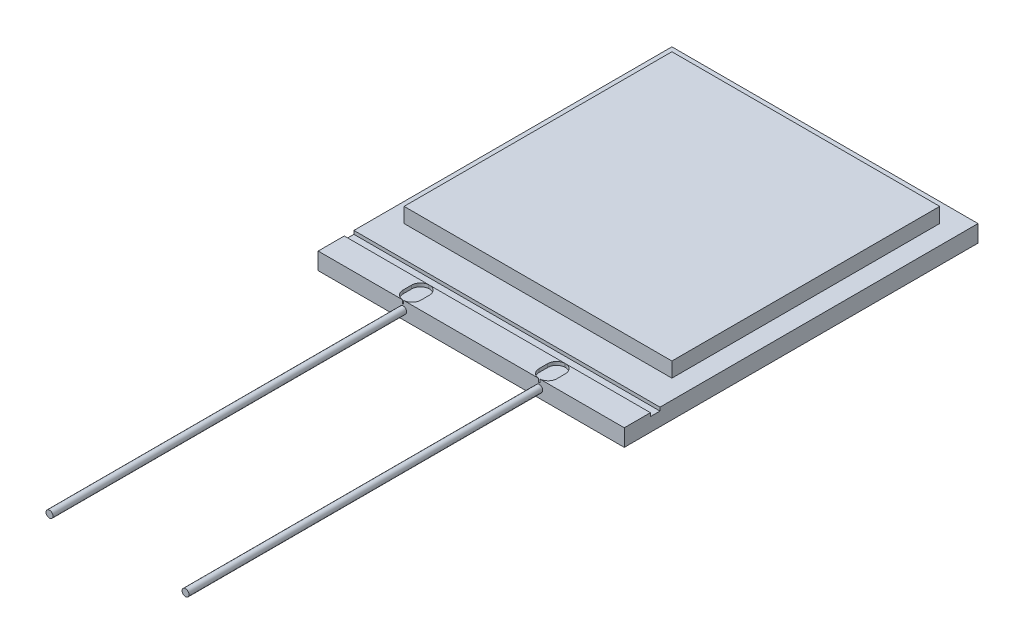
ISO-10303-21;
HEADER;
FILE_DESCRIPTION(('STEP AP214'),'2;1');
FILE_NAME('part.step','',(''),(''),'','','');
FILE_SCHEMA(('AUTOMOTIVE_DESIGN { 1 0 10303 214 1 1 1 1 }'));
ENDSEC;
DATA;
#1=APPLICATION_CONTEXT('core data for automotive mechanical design processes');
#2=APPLICATION_PROTOCOL_DEFINITION('international standard','automotive_design',2000,#1);
#3=PRODUCT_CONTEXT('',#1,'mechanical');
#4=PRODUCT('Part','Part','',(#3));
#5=PRODUCT_RELATED_PRODUCT_CATEGORY('part','',(#4));
#6=PRODUCT_DEFINITION_FORMATION('','',#4);
#7=PRODUCT_DEFINITION_CONTEXT('part definition',#1,'design');
#8=PRODUCT_DEFINITION('design','',#6,#7);
#9=PRODUCT_DEFINITION_SHAPE('','',#8);
#10=(LENGTH_UNIT() NAMED_UNIT(*) SI_UNIT(.MILLI.,.METRE.));
#11=(NAMED_UNIT(*) PLANE_ANGLE_UNIT() SI_UNIT($,.RADIAN.));
#12=(NAMED_UNIT(*) SI_UNIT($,.STERADIAN.) SOLID_ANGLE_UNIT());
#13=UNCERTAINTY_MEASURE_WITH_UNIT(LENGTH_MEASURE(1.E-05),#10,'distance_accuracy_value','');
#14=(GEOMETRIC_REPRESENTATION_CONTEXT(3) GLOBAL_UNCERTAINTY_ASSIGNED_CONTEXT((#13)) GLOBAL_UNIT_ASSIGNED_CONTEXT((#10,
#11,#12)) REPRESENTATION_CONTEXT('',''));
#15=CARTESIAN_POINT('',(0.,0.,0.));
#16=DIRECTION('',(0.,0.,1.));
#17=DIRECTION('',(1.,0.,0.));
#18=AXIS2_PLACEMENT_3D('',#15,#16,#17);
#19=CARTESIAN_POINT('',(5.715,0.635,6.604));
#20=DIRECTION('',(0.,0.,-1.));
#21=DIRECTION('',(-1.,0.,0.));
#22=AXIS2_PLACEMENT_3D('',#19,#20,#21);
#23=PLANE('',#22);
#24=DIRECTION('',(0.,1.,0.));
#25=VECTOR('',#24,1.);
#26=CARTESIAN_POINT('',(2.56024760363874,0.508,6.604));
#27=LINE('',#26,#25);
#28=CARTESIAN_POINT('',(2.56024760363874,0.508,6.604));
#29=VERTEX_POINT('',#28);
#30=CARTESIAN_POINT('',(2.56024760363874,0.635,6.604));
#31=VERTEX_POINT('',#30);
#32=EDGE_CURVE('E343',#29,#31,#27,.T.);
#33=ORIENTED_EDGE('',*,*,#32,.F.);
#34=DIRECTION('',(1.,0.,0.));
#35=VECTOR('',#34,1.);
#36=CARTESIAN_POINT('',(0.,0.508,6.604));
#37=LINE('',#36,#35);
#38=CARTESIAN_POINT('',(2.51975239636126,0.508,6.604));
#39=VERTEX_POINT('',#38);
#40=EDGE_CURVE('E693',#39,#29,#37,.T.);
#41=ORIENTED_EDGE('',*,*,#40,.F.);
#42=DIRECTION('',(0.,1.,0.));
#43=VECTOR('',#42,1.);
#44=CARTESIAN_POINT('',(2.51975239636126,0.508,6.604));
#45=LINE('',#44,#43);
#46=CARTESIAN_POINT('',(2.51975239636126,0.635,6.604));
#47=VERTEX_POINT('',#46);
#48=EDGE_CURVE('E360',#39,#47,#45,.T.);
#49=ORIENTED_EDGE('',*,*,#48,.T.);
#50=DIRECTION('',(1.,0.,0.));
#51=VECTOR('',#50,1.);
#52=CARTESIAN_POINT('',(5.715,0.635,6.604));
#53=LINE('',#52,#51);
#54=CARTESIAN_POINT('',(-2.51975239636126,0.635,6.604));
#55=VERTEX_POINT('',#54);
#56=EDGE_CURVE('E490',#55,#47,#53,.T.);
#57=ORIENTED_EDGE('',*,*,#56,.F.);
#58=DIRECTION('',(0.,1.,0.));
#59=VECTOR('',#58,1.);
#60=CARTESIAN_POINT('',(-2.51975239636126,0.508,6.604));
#61=LINE('',#60,#59);
#62=CARTESIAN_POINT('',(-2.51975239636126,0.508,6.604));
#63=VERTEX_POINT('',#62);
#64=EDGE_CURVE('E674',#63,#55,#61,.T.);
#65=ORIENTED_EDGE('',*,*,#64,.F.);
#66=DIRECTION('',(1.,0.,0.));
#67=VECTOR('',#66,1.);
#68=CARTESIAN_POINT('',(0.,0.508,6.604));
#69=LINE('',#68,#67);
#70=CARTESIAN_POINT('',(-2.56024760363874,0.508,6.604));
#71=VERTEX_POINT('',#70);
#72=EDGE_CURVE('E530',#71,#63,#69,.T.);
#73=ORIENTED_EDGE('',*,*,#72,.F.);
#74=DIRECTION('',(0.,1.,0.));
#75=VECTOR('',#74,1.);
#76=CARTESIAN_POINT('',(-2.56024760363874,0.508,6.604));
#77=LINE('',#76,#75);
#78=CARTESIAN_POINT('',(-2.56024760363874,0.635,6.604));
#79=VERTEX_POINT('',#78);
#80=EDGE_CURVE('E363',#71,#79,#77,.T.);
#81=ORIENTED_EDGE('',*,*,#80,.T.);
#82=CARTESIAN_POINT('',(-5.715,0.635,6.604));
#83=VERTEX_POINT('',#82);
#84=EDGE_CURVE('E486',#83,#79,#53,.T.);
#85=ORIENTED_EDGE('',*,*,#84,.F.);
#86=DIRECTION('',(0.,-1.,0.));
#87=VECTOR('',#86,1.);
#88=CARTESIAN_POINT('',(-5.715,0.635,6.604));
#89=LINE('',#88,#87);
#90=CARTESIAN_POINT('',(-5.715,0.,6.604));
#91=VERTEX_POINT('',#90);
#92=EDGE_CURVE('E504',#83,#91,#89,.T.);
#93=ORIENTED_EDGE('',*,*,#92,.T.);
#94=DIRECTION('',(1.,0.,0.));
#95=VECTOR('',#94,1.);
#96=CARTESIAN_POINT('',(5.715,0.,6.604));
#97=LINE('',#96,#95);
#98=CARTESIAN_POINT('',(5.715,0.,6.604));
#99=VERTEX_POINT('',#98);
#100=EDGE_CURVE('E501',#91,#99,#97,.T.);
#101=ORIENTED_EDGE('',*,*,#100,.T.);
#102=DIRECTION('',(0.,-1.,0.));
#103=VECTOR('',#102,1.);
#104=CARTESIAN_POINT('',(5.715,0.635,6.604));
#105=LINE('',#104,#103);
#106=CARTESIAN_POINT('',(5.715,0.635,6.604));
#107=VERTEX_POINT('',#106);
#108=EDGE_CURVE('E444',#107,#99,#105,.T.);
#109=ORIENTED_EDGE('',*,*,#108,.F.);
#110=EDGE_CURVE('E346',#31,#107,#53,.T.);
#111=ORIENTED_EDGE('',*,*,#110,.F.);
#112=EDGE_LOOP('',(#33,#41,#49,#57,#65,#73,#81,#85,#93,#101,#109,#111));
#113=FACE_BOUND('',#112,.T.);
#114=CARTESIAN_POINT('',(-2.54,0.3175,6.604));
#115=DIRECTION('',(0.,0.,-1.));
#116=DIRECTION('',(-1.,0.,0.));
#117=AXIS2_PLACEMENT_3D('',#114,#115,#116);
#118=CIRCLE('',#117,0.129854710524441);
#119=CARTESIAN_POINT('',(-2.66985471052444,0.3175,6.604));
#120=VERTEX_POINT('',#119);
#121=EDGE_CURVE('E153',#120,#120,#118,.F.);
#122=ORIENTED_EDGE('',*,*,#121,.F.);
#123=EDGE_LOOP('',(#122));
#124=FACE_BOUND('',#123,.T.);
#125=CARTESIAN_POINT('',(2.54,0.3175,6.604));
#126=DIRECTION('',(0.,0.,-1.));
#127=DIRECTION('',(-1.,0.,0.));
#128=AXIS2_PLACEMENT_3D('',#125,#126,#127);
#129=CIRCLE('',#128,0.129854710524441);
#130=CARTESIAN_POINT('',(2.41014528947556,0.3175,6.604));
#131=VERTEX_POINT('',#130);
#132=EDGE_CURVE('E13',#131,#131,#129,.F.);
#133=ORIENTED_EDGE('',*,*,#132,.F.);
#134=EDGE_LOOP('',(#133));
#135=FACE_BOUND('',#134,.T.);
#136=ADVANCED_FACE('F144',(#113,#124,#135),#23,.F.);
#137=CARTESIAN_POINT('',(-5.715,0.635,-6.604));
#138=DIRECTION('',(0.,1.,0.));
#139=DIRECTION('',(0.,0.,1.));
#140=AXIS2_PLACEMENT_3D('',#137,#138,#139);
#141=PLANE('',#140);
#142=DIRECTION('',(1.,0.,0.));
#143=VECTOR('',#142,1.);
#144=CARTESIAN_POINT('',(0.,0.635,5.62864));
#145=LINE('',#144,#143);
#146=CARTESIAN_POINT('',(2.56511819770642,0.635,5.62864));
#147=VERTEX_POINT('',#146);
#148=CARTESIAN_POINT('',(5.715,0.635,5.62864));
#149=VERTEX_POINT('',#148);
#150=EDGE_CURVE('E382',#147,#149,#145,.T.);
#151=ORIENTED_EDGE('',*,*,#150,.F.);
#152=CARTESIAN_POINT('',(2.54,0.635,5.95788324768168));
#153=DIRECTION('',(0.,1.,0.));
#154=DIRECTION('',(0.,0.,1.));
#155=AXIS2_PLACEMENT_3D('',#152,#153,#154);
#156=CIRCLE('',#155,0.3302);
#157=CARTESIAN_POINT('',(2.8702,0.635,5.95788324768168));
#158=VERTEX_POINT('',#157);
#159=EDGE_CURVE('E347',#147,#158,#156,.F.);
#160=ORIENTED_EDGE('',*,*,#159,.T.);
#161=DIRECTION('',(0.,0.,-1.));
#162=VECTOR('',#161,1.);
#163=CARTESIAN_POINT('',(2.8702,0.635,0.));
#164=LINE('',#163,#162);
#165=CARTESIAN_POINT('',(2.8702,0.635,6.27442136818827));
#166=VERTEX_POINT('',#165);
#167=EDGE_CURVE('E331',#166,#158,#164,.T.);
#168=ORIENTED_EDGE('',*,*,#167,.F.);
#169=CARTESIAN_POINT('',(2.54,0.635,6.27442136818827));
#170=DIRECTION('',(0.,1.,0.));
#171=DIRECTION('',(0.,0.,1.));
#172=AXIS2_PLACEMENT_3D('',#169,#170,#171);
#173=CIRCLE('',#172,0.3302);
#174=EDGE_CURVE('E340',#166,#31,#173,.F.);
#175=ORIENTED_EDGE('',*,*,#174,.T.);
#176=ORIENTED_EDGE('',*,*,#110,.T.);
#177=DIRECTION('',(0.,0.,-1.));
#178=VECTOR('',#177,1.);
#179=CARTESIAN_POINT('',(5.715,0.635,6.604));
#180=LINE('',#179,#178);
#181=EDGE_CURVE('E491',#107,#149,#180,.T.);
#182=ORIENTED_EDGE('',*,*,#181,.T.);
#183=EDGE_LOOP('',(#151,#160,#168,#175,#176,#182));
#184=FACE_BOUND('',#183,.T.);
#185=ADVANCED_FACE('F351',(#184),#141,.T.);
#186=DIRECTION('',(0.,0.,-1.));
#187=VECTOR('',#186,1.);
#188=CARTESIAN_POINT('',(2.2098,0.635,0.));
#189=LINE('',#188,#187);
#190=CARTESIAN_POINT('',(2.2098,0.635,6.27442136818827));
#191=VERTEX_POINT('',#190);
#192=CARTESIAN_POINT('',(2.2098,0.635,5.95788324768168));
#193=VERTEX_POINT('',#192);
#194=EDGE_CURVE('E494',#191,#193,#189,.T.);
#195=ORIENTED_EDGE('',*,*,#194,.T.);
#196=CARTESIAN_POINT('',(2.51488180229358,0.635,5.62864));
#197=VERTEX_POINT('',#196);
#198=EDGE_CURVE('E547',#193,#197,#156,.F.);
#199=ORIENTED_EDGE('',*,*,#198,.T.);
#200=CARTESIAN_POINT('',(-2.51488180229357,0.635,5.62864));
#201=VERTEX_POINT('',#200);
#202=EDGE_CURVE('E393',#201,#197,#145,.T.);
#203=ORIENTED_EDGE('',*,*,#202,.F.);
#204=CARTESIAN_POINT('',(-2.54,0.635,5.95788324768168));
#205=DIRECTION('',(0.,1.,0.));
#206=DIRECTION('',(0.,0.,1.));
#207=AXIS2_PLACEMENT_3D('',#204,#205,#206);
#208=CIRCLE('',#207,0.3302);
#209=CARTESIAN_POINT('',(-2.2098,0.635,5.95788324768168));
#210=VERTEX_POINT('',#209);
#211=EDGE_CURVE('E391',#210,#201,#208,.T.);
#212=ORIENTED_EDGE('',*,*,#211,.F.);
#213=DIRECTION('',(0.,0.,-1.));
#214=VECTOR('',#213,1.);
#215=CARTESIAN_POINT('',(-2.2098,0.635,0.));
#216=LINE('',#215,#214);
#217=CARTESIAN_POINT('',(-2.2098,0.635,6.27442136818827));
#218=VERTEX_POINT('',#217);
#219=EDGE_CURVE('E517',#218,#210,#216,.T.);
#220=ORIENTED_EDGE('',*,*,#219,.F.);
#221=CARTESIAN_POINT('',(-2.54,0.635,6.27442136818827));
#222=DIRECTION('',(0.,1.,0.));
#223=DIRECTION('',(0.,0.,1.));
#224=AXIS2_PLACEMENT_3D('',#221,#222,#223);
#225=CIRCLE('',#224,0.3302);
#226=EDGE_CURVE('E676',#55,#218,#225,.T.);
#227=ORIENTED_EDGE('',*,*,#226,.F.);
#228=ORIENTED_EDGE('',*,*,#56,.T.);
#229=EDGE_CURVE('E349',#47,#191,#173,.F.);
#230=ORIENTED_EDGE('',*,*,#229,.T.);
#231=EDGE_LOOP('',(#195,#199,#203,#212,#220,#227,#228,#230));
#232=FACE_BOUND('',#231,.T.);
#233=ADVANCED_FACE('F559',(#232),#141,.T.);
#234=CARTESIAN_POINT('',(-2.8702,0.635,6.27442136818827));
#235=VERTEX_POINT('',#234);
#236=EDGE_CURVE('E615',#235,#79,#225,.T.);
#237=ORIENTED_EDGE('',*,*,#236,.F.);
#238=DIRECTION('',(0.,0.,-1.));
#239=VECTOR('',#238,1.);
#240=CARTESIAN_POINT('',(-2.8702,0.635,0.));
#241=LINE('',#240,#239);
#242=CARTESIAN_POINT('',(-2.8702,0.635,5.95788324768168));
#243=VERTEX_POINT('',#242);
#244=EDGE_CURVE('E503',#235,#243,#241,.T.);
#245=ORIENTED_EDGE('',*,*,#244,.T.);
#246=CARTESIAN_POINT('',(-2.56511819770643,0.635,5.62864));
#247=VERTEX_POINT('',#246);
#248=EDGE_CURVE('E392',#247,#243,#208,.T.);
#249=ORIENTED_EDGE('',*,*,#248,.F.);
#250=CARTESIAN_POINT('',(-5.715,0.635,5.62864));
#251=VERTEX_POINT('',#250);
#252=EDGE_CURVE('E396',#251,#247,#145,.T.);
#253=ORIENTED_EDGE('',*,*,#252,.F.);
#254=DIRECTION('',(0.,0.,1.));
#255=VECTOR('',#254,1.);
#256=CARTESIAN_POINT('',(-5.715,0.635,6.604));
#257=LINE('',#256,#255);
#258=EDGE_CURVE('E487',#251,#83,#257,.T.);
#259=ORIENTED_EDGE('',*,*,#258,.T.);
#260=ORIENTED_EDGE('',*,*,#84,.T.);
#261=EDGE_LOOP('',(#237,#245,#249,#253,#259,#260));
#262=FACE_BOUND('',#261,.T.);
#263=ADVANCED_FACE('F613',(#262),#141,.T.);
#264=DIRECTION('',(1.,0.,0.));
#265=VECTOR('',#264,1.);
#266=CARTESIAN_POINT('',(5.0000027,0.635,4.1110027));
#267=LINE('',#266,#265);
#268=CARTESIAN_POINT('',(-5.0000027,0.635,4.1110027));
#269=VERTEX_POINT('',#268);
#270=CARTESIAN_POINT('',(5.0000027,0.635,4.1110027));
#271=VERTEX_POINT('',#270);
#272=EDGE_CURVE('E467',#269,#271,#267,.T.);
#273=ORIENTED_EDGE('',*,*,#272,.F.);
#274=DIRECTION('',(0.,0.,1.));
#275=VECTOR('',#274,1.);
#276=CARTESIAN_POINT('',(-5.0000027,0.635,4.1110027));
#277=LINE('',#276,#275);
#278=CARTESIAN_POINT('',(-5.0000027,0.635,-5.8890027));
#279=VERTEX_POINT('',#278);
#280=EDGE_CURVE('E462',#279,#269,#277,.T.);
#281=ORIENTED_EDGE('',*,*,#280,.F.);
#282=DIRECTION('',(-1.,0.,0.));
#283=VECTOR('',#282,1.);
#284=CARTESIAN_POINT('',(5.0000027,0.635,-5.8890027));
#285=LINE('',#284,#283);
#286=CARTESIAN_POINT('',(5.0000027,0.635,-5.8890027));
#287=VERTEX_POINT('',#286);
#288=EDGE_CURVE('E474',#287,#279,#285,.T.);
#289=ORIENTED_EDGE('',*,*,#288,.F.);
#290=DIRECTION('',(0.,0.,-1.));
#291=VECTOR('',#290,1.);
#292=CARTESIAN_POINT('',(5.0000027,0.635,4.1110027));
#293=LINE('',#292,#291);
#294=EDGE_CURVE('E470',#271,#287,#293,.T.);
#295=ORIENTED_EDGE('',*,*,#294,.F.);
#296=EDGE_LOOP('',(#273,#281,#289,#295));
#297=FACE_BOUND('',#296,.T.);
#298=CARTESIAN_POINT('',(-5.715,0.635,-6.604));
#299=VERTEX_POINT('',#298);
#300=CARTESIAN_POINT('',(-5.715,0.635,5.2705));
#301=VERTEX_POINT('',#300);
#302=EDGE_CURVE('E483',#299,#301,#257,.T.);
#303=ORIENTED_EDGE('',*,*,#302,.T.);
#304=DIRECTION('',(1.,0.,0.));
#305=VECTOR('',#304,1.);
#306=CARTESIAN_POINT('',(0.,0.635,5.2705));
#307=LINE('',#306,#305);
#308=CARTESIAN_POINT('',(5.715,0.635,5.2705));
#309=VERTEX_POINT('',#308);
#310=EDGE_CURVE('E408',#301,#309,#307,.T.);
#311=ORIENTED_EDGE('',*,*,#310,.T.);
#312=CARTESIAN_POINT('',(5.715,0.635,-6.604));
#313=VERTEX_POINT('',#312);
#314=EDGE_CURVE('E495',#309,#313,#180,.T.);
#315=ORIENTED_EDGE('',*,*,#314,.T.);
#316=DIRECTION('',(-1.,0.,0.));
#317=VECTOR('',#316,1.);
#318=CARTESIAN_POINT('',(5.715,0.635,-6.604));
#319=LINE('',#318,#317);
#320=EDGE_CURVE('E445',#313,#299,#319,.T.);
#321=ORIENTED_EDGE('',*,*,#320,.T.);
#322=EDGE_LOOP('',(#303,#311,#315,#321));
#323=FACE_BOUND('',#322,.T.);
#324=ADVANCED_FACE('F588',(#297,#323),#141,.T.);
#325=CARTESIAN_POINT('',(5.715,0.635,6.604));
#326=DIRECTION('',(-1.,0.,0.));
#327=DIRECTION('',(0.,0.,1.));
#328=AXIS2_PLACEMENT_3D('',#325,#326,#327);
#329=PLANE('',#328);
#330=DIRECTION('',(0.,1.,0.));
#331=VECTOR('',#330,1.);
#332=CARTESIAN_POINT('',(5.715,0.508,5.2705));
#333=LINE('',#332,#331);
#334=CARTESIAN_POINT('',(5.715,0.508,5.2705));
#335=VERTEX_POINT('',#334);
#336=EDGE_CURVE('E414',#335,#309,#333,.T.);
#337=ORIENTED_EDGE('',*,*,#336,.F.);
#338=DIRECTION('',(0.,0.,-1.));
#339=VECTOR('',#338,1.);
#340=CARTESIAN_POINT('',(5.715,0.508,0.));
#341=LINE('',#340,#339);
#342=CARTESIAN_POINT('',(5.715,0.508,5.62864));
#343=VERTEX_POINT('',#342);
#344=EDGE_CURVE('E418',#343,#335,#341,.T.);
#345=ORIENTED_EDGE('',*,*,#344,.F.);
#346=DIRECTION('',(0.,1.,0.));
#347=VECTOR('',#346,1.);
#348=CARTESIAN_POINT('',(5.715,0.508,5.62864));
#349=LINE('',#348,#347);
#350=EDGE_CURVE('E442',#343,#149,#349,.T.);
#351=ORIENTED_EDGE('',*,*,#350,.T.);
#352=ORIENTED_EDGE('',*,*,#181,.F.);
#353=ORIENTED_EDGE('',*,*,#108,.T.);
#354=DIRECTION('',(0.,0.,-1.));
#355=VECTOR('',#354,1.);
#356=CARTESIAN_POINT('',(5.715,0.,6.604));
#357=LINE('',#356,#355);
#358=CARTESIAN_POINT('',(5.715,0.,-6.604));
#359=VERTEX_POINT('',#358);
#360=EDGE_CURVE('E440',#99,#359,#357,.T.);
#361=ORIENTED_EDGE('',*,*,#360,.T.);
#362=DIRECTION('',(0.,-1.,0.));
#363=VECTOR('',#362,1.);
#364=CARTESIAN_POINT('',(5.715,0.635,-6.604));
#365=LINE('',#364,#363);
#366=EDGE_CURVE('E466',#313,#359,#365,.T.);
#367=ORIENTED_EDGE('',*,*,#366,.F.);
#368=ORIENTED_EDGE('',*,*,#314,.F.);
#369=EDGE_LOOP('',(#337,#345,#351,#352,#353,#361,#367,#368));
#370=FACE_BOUND('',#369,.T.);
#371=ADVANCED_FACE('F591',(#370),#329,.F.);
#372=CARTESIAN_POINT('',(-5.715,0.635,6.604));
#373=DIRECTION('',(1.,0.,0.));
#374=DIRECTION('',(0.,0.,-1.));
#375=AXIS2_PLACEMENT_3D('',#372,#373,#374);
#376=PLANE('',#375);
#377=ORIENTED_EDGE('',*,*,#258,.F.);
#378=DIRECTION('',(0.,1.,0.));
#379=VECTOR('',#378,1.);
#380=CARTESIAN_POINT('',(-5.715,0.508,5.62864));
#381=LINE('',#380,#379);
#382=CARTESIAN_POINT('',(-5.715,0.508,5.62864));
#383=VERTEX_POINT('',#382);
#384=EDGE_CURVE('E399',#383,#251,#381,.T.);
#385=ORIENTED_EDGE('',*,*,#384,.F.);
#386=DIRECTION('',(0.,0.,1.));
#387=VECTOR('',#386,1.);
#388=CARTESIAN_POINT('',(-5.715,0.508,0.));
#389=LINE('',#388,#387);
#390=CARTESIAN_POINT('',(-5.715,0.508,5.2705));
#391=VERTEX_POINT('',#390);
#392=EDGE_CURVE('E406',#391,#383,#389,.T.);
#393=ORIENTED_EDGE('',*,*,#392,.F.);
#394=DIRECTION('',(0.,1.,0.));
#395=VECTOR('',#394,1.);
#396=CARTESIAN_POINT('',(-5.715,0.508,5.2705));
#397=LINE('',#396,#395);
#398=EDGE_CURVE('E437',#391,#301,#397,.T.);
#399=ORIENTED_EDGE('',*,*,#398,.T.);
#400=ORIENTED_EDGE('',*,*,#302,.F.);
#401=DIRECTION('',(0.,-1.,0.));
#402=VECTOR('',#401,1.);
#403=CARTESIAN_POINT('',(-5.715,0.635,-6.604));
#404=LINE('',#403,#402);
#405=CARTESIAN_POINT('',(-5.715,0.,-6.604));
#406=VERTEX_POINT('',#405);
#407=EDGE_CURVE('E439',#299,#406,#404,.T.);
#408=ORIENTED_EDGE('',*,*,#407,.T.);
#409=DIRECTION('',(0.,0.,1.));
#410=VECTOR('',#409,1.);
#411=CARTESIAN_POINT('',(-5.715,0.,6.604));
#412=LINE('',#411,#410);
#413=EDGE_CURVE('E497',#406,#91,#412,.T.);
#414=ORIENTED_EDGE('',*,*,#413,.T.);
#415=ORIENTED_EDGE('',*,*,#92,.F.);
#416=EDGE_LOOP('',(#377,#385,#393,#399,#400,#408,#414,#415));
#417=FACE_BOUND('',#416,.T.);
#418=ADVANCED_FACE('F593',(#417),#376,.F.);
#419=CARTESIAN_POINT('',(5.715,0.635,-6.604));
#420=DIRECTION('',(0.,0.,1.));
#421=DIRECTION('',(1.,0.,0.));
#422=AXIS2_PLACEMENT_3D('',#419,#420,#421);
#423=PLANE('',#422);
#424=DIRECTION('',(-1.,0.,0.));
#425=VECTOR('',#424,1.);
#426=CARTESIAN_POINT('',(5.715,0.,-6.604));
#427=LINE('',#426,#425);
#428=EDGE_CURVE('E500',#359,#406,#427,.T.);
#429=ORIENTED_EDGE('',*,*,#428,.T.);
#430=ORIENTED_EDGE('',*,*,#407,.F.);
#431=ORIENTED_EDGE('',*,*,#320,.F.);
#432=ORIENTED_EDGE('',*,*,#366,.T.);
#433=EDGE_LOOP('',(#429,#430,#431,#432));
#434=FACE_BOUND('',#433,.T.);
#435=ADVANCED_FACE('F595',(#434),#423,.F.);
#436=CARTESIAN_POINT('',(-5.715,0.,-6.604));
#437=DIRECTION('',(0.,1.,0.));
#438=DIRECTION('',(0.,0.,1.));
#439=AXIS2_PLACEMENT_3D('',#436,#437,#438);
#440=PLANE('',#439);
#441=ORIENTED_EDGE('',*,*,#413,.F.);
#442=ORIENTED_EDGE('',*,*,#428,.F.);
#443=ORIENTED_EDGE('',*,*,#360,.F.);
#444=ORIENTED_EDGE('',*,*,#100,.F.);
#445=EDGE_LOOP('',(#441,#442,#443,#444));
#446=FACE_BOUND('',#445,.T.);
#447=ADVANCED_FACE('F601',(#446),#440,.F.);
#448=CARTESIAN_POINT('',(-5.0000027,1.190625,4.1110027));
#449=DIRECTION('',(1.,0.,0.));
#450=DIRECTION('',(0.,0.,-1.));
#451=AXIS2_PLACEMENT_3D('',#448,#449,#450);
#452=PLANE('',#451);
#453=ORIENTED_EDGE('',*,*,#280,.T.);
#454=DIRECTION('',(0.,-1.,0.));
#455=VECTOR('',#454,1.);
#456=CARTESIAN_POINT('',(-5.0000027,1.190625,4.1110027));
#457=LINE('',#456,#455);
#458=CARTESIAN_POINT('',(-5.0000027,1.190625,4.1110027));
#459=VERTEX_POINT('',#458);
#460=EDGE_CURVE('E469',#459,#269,#457,.T.);
#461=ORIENTED_EDGE('',*,*,#460,.F.);
#462=DIRECTION('',(0.,0.,1.));
#463=VECTOR('',#462,1.);
#464=CARTESIAN_POINT('',(-5.0000027,1.190625,4.1110027));
#465=LINE('',#464,#463);
#466=CARTESIAN_POINT('',(-5.0000027,1.190625,-5.8890027));
#467=VERTEX_POINT('',#466);
#468=EDGE_CURVE('E419',#467,#459,#465,.T.);
#469=ORIENTED_EDGE('',*,*,#468,.F.);
#470=DIRECTION('',(0.,-1.,0.));
#471=VECTOR('',#470,1.);
#472=CARTESIAN_POINT('',(-5.0000027,1.190625,-5.8890027));
#473=LINE('',#472,#471);
#474=EDGE_CURVE('E465',#467,#279,#473,.T.);
#475=ORIENTED_EDGE('',*,*,#474,.T.);
#476=EDGE_LOOP('',(#453,#461,#469,#475));
#477=FACE_BOUND('',#476,.T.);
#478=ADVANCED_FACE('F779',(#477),#452,.F.);
#479=CARTESIAN_POINT('',(5.0000027,1.190625,4.1110027));
#480=DIRECTION('',(0.,0.,-1.));
#481=DIRECTION('',(-1.,0.,0.));
#482=AXIS2_PLACEMENT_3D('',#479,#480,#481);
#483=PLANE('',#482);
#484=ORIENTED_EDGE('',*,*,#272,.T.);
#485=DIRECTION('',(0.,-1.,0.));
#486=VECTOR('',#485,1.);
#487=CARTESIAN_POINT('',(5.0000027,1.190625,4.1110027));
#488=LINE('',#487,#486);
#489=CARTESIAN_POINT('',(5.0000027,1.190625,4.1110027));
#490=VERTEX_POINT('',#489);
#491=EDGE_CURVE('E473',#490,#271,#488,.T.);
#492=ORIENTED_EDGE('',*,*,#491,.F.);
#493=DIRECTION('',(1.,0.,0.));
#494=VECTOR('',#493,1.);
#495=CARTESIAN_POINT('',(5.0000027,1.190625,4.1110027));
#496=LINE('',#495,#494);
#497=EDGE_CURVE('E459',#459,#490,#496,.T.);
#498=ORIENTED_EDGE('',*,*,#497,.F.);
#499=ORIENTED_EDGE('',*,*,#460,.T.);
#500=EDGE_LOOP('',(#484,#492,#498,#499));
#501=FACE_BOUND('',#500,.T.);
#502=ADVANCED_FACE('F769',(#501),#483,.F.);
#503=CARTESIAN_POINT('',(5.0000027,1.190625,4.1110027));
#504=DIRECTION('',(-1.,0.,0.));
#505=DIRECTION('',(0.,0.,1.));
#506=AXIS2_PLACEMENT_3D('',#503,#504,#505);
#507=PLANE('',#506);
#508=ORIENTED_EDGE('',*,*,#294,.T.);
#509=DIRECTION('',(0.,-1.,0.));
#510=VECTOR('',#509,1.);
#511=CARTESIAN_POINT('',(5.0000027,1.190625,-5.8890027));
#512=LINE('',#511,#510);
#513=CARTESIAN_POINT('',(5.0000027,1.190625,-5.8890027));
#514=VERTEX_POINT('',#513);
#515=EDGE_CURVE('E476',#514,#287,#512,.T.);
#516=ORIENTED_EDGE('',*,*,#515,.F.);
#517=DIRECTION('',(0.,0.,-1.));
#518=VECTOR('',#517,1.);
#519=CARTESIAN_POINT('',(5.0000027,1.190625,4.1110027));
#520=LINE('',#519,#518);
#521=EDGE_CURVE('E453',#490,#514,#520,.T.);
#522=ORIENTED_EDGE('',*,*,#521,.F.);
#523=ORIENTED_EDGE('',*,*,#491,.T.);
#524=EDGE_LOOP('',(#508,#516,#522,#523));
#525=FACE_BOUND('',#524,.T.);
#526=ADVANCED_FACE('F759',(#525),#507,.F.);
#527=CARTESIAN_POINT('',(5.0000027,1.190625,-5.8890027));
#528=DIRECTION('',(0.,0.,1.));
#529=DIRECTION('',(1.,0.,0.));
#530=AXIS2_PLACEMENT_3D('',#527,#528,#529);
#531=PLANE('',#530);
#532=ORIENTED_EDGE('',*,*,#288,.T.);
#533=ORIENTED_EDGE('',*,*,#474,.F.);
#534=DIRECTION('',(-1.,0.,0.));
#535=VECTOR('',#534,1.);
#536=CARTESIAN_POINT('',(5.0000027,1.190625,-5.8890027));
#537=LINE('',#536,#535);
#538=EDGE_CURVE('E451',#514,#467,#537,.T.);
#539=ORIENTED_EDGE('',*,*,#538,.F.);
#540=ORIENTED_EDGE('',*,*,#515,.T.);
#541=EDGE_LOOP('',(#532,#533,#539,#540));
#542=FACE_BOUND('',#541,.T.);
#543=ADVANCED_FACE('F750',(#542),#531,.F.);
#544=CARTESIAN_POINT('',(-5.0000027,1.190625,-5.8890027));
#545=DIRECTION('',(0.,1.,0.));
#546=DIRECTION('',(0.,0.,1.));
#547=AXIS2_PLACEMENT_3D('',#544,#545,#546);
#548=PLANE('',#547);
#549=ORIENTED_EDGE('',*,*,#468,.T.);
#550=ORIENTED_EDGE('',*,*,#497,.T.);
#551=ORIENTED_EDGE('',*,*,#521,.T.);
#552=ORIENTED_EDGE('',*,*,#538,.T.);
#553=EDGE_LOOP('',(#549,#550,#551,#552));
#554=FACE_BOUND('',#553,.T.);
#555=ADVANCED_FACE('F637',(#554),#548,.T.);
#556=CARTESIAN_POINT('',(0.,0.508,5.62864));
#557=DIRECTION('',(0.,0.,1.));
#558=DIRECTION('',(1.,0.,0.));
#559=AXIS2_PLACEMENT_3D('',#556,#557,#558);
#560=PLANE('',#559);
#561=ORIENTED_EDGE('',*,*,#202,.T.);
#562=DIRECTION('',(0.,1.,0.));
#563=VECTOR('',#562,1.);
#564=CARTESIAN_POINT('',(2.51488180229358,0.508,5.62864));
#565=LINE('',#564,#563);
#566=CARTESIAN_POINT('',(2.51488180229358,0.508,5.62864));
#567=VERTEX_POINT('',#566);
#568=EDGE_CURVE('E160',#567,#197,#565,.T.);
#569=ORIENTED_EDGE('',*,*,#568,.F.);
#570=DIRECTION('',(1.,0.,0.));
#571=VECTOR('',#570,1.);
#572=CARTESIAN_POINT('',(0.,0.508,5.62864));
#573=LINE('',#572,#571);
#574=CARTESIAN_POINT('',(-2.51488180229357,0.508,5.62864));
#575=VERTEX_POINT('',#574);
#576=EDGE_CURVE('E381',#575,#567,#573,.T.);
#577=ORIENTED_EDGE('',*,*,#576,.F.);
#578=DIRECTION('',(0.,1.,0.));
#579=VECTOR('',#578,1.);
#580=CARTESIAN_POINT('',(-2.51488180229357,0.508,5.62864));
#581=LINE('',#580,#579);
#582=EDGE_CURVE('E400',#575,#201,#581,.T.);
#583=ORIENTED_EDGE('',*,*,#582,.T.);
#584=EDGE_LOOP('',(#561,#569,#577,#583));
#585=FACE_BOUND('',#584,.T.);
#586=ADVANCED_FACE('F629',(#585),#560,.F.);
#587=ORIENTED_EDGE('',*,*,#252,.T.);
#588=DIRECTION('',(0.,1.,0.));
#589=VECTOR('',#588,1.);
#590=CARTESIAN_POINT('',(-2.56511819770643,0.508,5.62864));
#591=LINE('',#590,#589);
#592=CARTESIAN_POINT('',(-2.56511819770643,0.508,5.62864));
#593=VERTEX_POINT('',#592);
#594=EDGE_CURVE('E388',#593,#247,#591,.T.);
#595=ORIENTED_EDGE('',*,*,#594,.F.);
#596=EDGE_CURVE('E415',#383,#593,#573,.T.);
#597=ORIENTED_EDGE('',*,*,#596,.F.);
#598=ORIENTED_EDGE('',*,*,#384,.T.);
#599=EDGE_LOOP('',(#587,#595,#597,#598));
#600=FACE_BOUND('',#599,.T.);
#601=ADVANCED_FACE('F626',(#600),#560,.F.);
#602=CARTESIAN_POINT('',(0.,0.508,5.2705));
#603=DIRECTION('',(0.,0.,1.));
#604=DIRECTION('',(1.,0.,0.));
#605=AXIS2_PLACEMENT_3D('',#602,#603,#604);
#606=PLANE('',#605);
#607=ORIENTED_EDGE('',*,*,#310,.F.);
#608=ORIENTED_EDGE('',*,*,#398,.F.);
#609=DIRECTION('',(1.,0.,0.));
#610=VECTOR('',#609,1.);
#611=CARTESIAN_POINT('',(0.,0.508,5.2705));
#612=LINE('',#611,#610);
#613=EDGE_CURVE('E429',#391,#335,#612,.T.);
#614=ORIENTED_EDGE('',*,*,#613,.T.);
#615=ORIENTED_EDGE('',*,*,#336,.T.);
#616=EDGE_LOOP('',(#607,#608,#614,#615));
#617=FACE_BOUND('',#616,.T.);
#618=ADVANCED_FACE('F628',(#617),#606,.T.);
#619=ORIENTED_EDGE('',*,*,#150,.T.);
#620=ORIENTED_EDGE('',*,*,#350,.F.);
#621=CARTESIAN_POINT('',(2.56511819770642,0.508,5.62864));
#622=VERTEX_POINT('',#621);
#623=EDGE_CURVE('E416',#622,#343,#573,.T.);
#624=ORIENTED_EDGE('',*,*,#623,.F.);
#625=DIRECTION('',(0.,1.,0.));
#626=VECTOR('',#625,1.);
#627=CARTESIAN_POINT('',(2.56511819770642,0.508,5.62864));
#628=LINE('',#627,#626);
#629=EDGE_CURVE('E378',#622,#147,#628,.T.);
#630=ORIENTED_EDGE('',*,*,#629,.T.);
#631=EDGE_LOOP('',(#619,#620,#624,#630));
#632=FACE_BOUND('',#631,.T.);
#633=ADVANCED_FACE('F631',(#632),#560,.F.);
#634=CARTESIAN_POINT('',(0.,0.508,0.));
#635=DIRECTION('',(0.,1.,0.));
#636=DIRECTION('',(0.,0.,1.));
#637=AXIS2_PLACEMENT_3D('',#634,#635,#636);
#638=PLANE('',#637);
#639=ORIENTED_EDGE('',*,*,#576,.T.);
#640=CARTESIAN_POINT('',(2.54,0.508,5.95788324768168));
#641=DIRECTION('',(0.,1.,0.));
#642=DIRECTION('',(0.,0.,1.));
#643=AXIS2_PLACEMENT_3D('',#640,#641,#642);
#644=CIRCLE('',#643,0.3302);
#645=CARTESIAN_POINT('',(2.2098,0.508,5.95788324768168));
#646=VERTEX_POINT('',#645);
#647=EDGE_CURVE('E358',#646,#567,#644,.F.);
#648=ORIENTED_EDGE('',*,*,#647,.F.);
#649=DIRECTION('',(0.,0.,-1.));
#650=VECTOR('',#649,1.);
#651=CARTESIAN_POINT('',(2.2098,0.508,0.));
#652=LINE('',#651,#650);
#653=CARTESIAN_POINT('',(2.2098,0.508,6.27442136818827));
#654=VERTEX_POINT('',#653);
#655=EDGE_CURVE('E369',#654,#646,#652,.T.);
#656=ORIENTED_EDGE('',*,*,#655,.F.);
#657=CARTESIAN_POINT('',(2.54,0.508,6.27442136818827));
#658=DIRECTION('',(0.,1.,0.));
#659=DIRECTION('',(0.,0.,1.));
#660=AXIS2_PLACEMENT_3D('',#657,#658,#659);
#661=CIRCLE('',#660,0.3302);
#662=EDGE_CURVE('E366',#39,#654,#661,.F.);
#663=ORIENTED_EDGE('',*,*,#662,.F.);
#664=ORIENTED_EDGE('',*,*,#40,.T.);
#665=CARTESIAN_POINT('',(2.8702,0.508,6.27442136818827));
#666=VERTEX_POINT('',#665);
#667=EDGE_CURVE('E353',#666,#29,#661,.F.);
#668=ORIENTED_EDGE('',*,*,#667,.F.);
#669=DIRECTION('',(0.,0.,-1.));
#670=VECTOR('',#669,1.);
#671=CARTESIAN_POINT('',(2.8702,0.508,0.));
#672=LINE('',#671,#670);
#673=CARTESIAN_POINT('',(2.8702,0.508,5.95788324768168));
#674=VERTEX_POINT('',#673);
#675=EDGE_CURVE('E334',#666,#674,#672,.T.);
#676=ORIENTED_EDGE('',*,*,#675,.T.);
#677=EDGE_CURVE('E337',#622,#674,#644,.F.);
#678=ORIENTED_EDGE('',*,*,#677,.F.);
#679=ORIENTED_EDGE('',*,*,#623,.T.);
#680=ORIENTED_EDGE('',*,*,#344,.T.);
#681=ORIENTED_EDGE('',*,*,#613,.F.);
#682=ORIENTED_EDGE('',*,*,#392,.T.);
#683=ORIENTED_EDGE('',*,*,#596,.T.);
#684=CARTESIAN_POINT('',(-2.54,0.508,5.95788324768168));
#685=DIRECTION('',(0.,1.,0.));
#686=DIRECTION('',(0.,0.,1.));
#687=AXIS2_PLACEMENT_3D('',#684,#685,#686);
#688=CIRCLE('',#687,0.3302);
#689=CARTESIAN_POINT('',(-2.8702,0.508,5.95788324768168));
#690=VERTEX_POINT('',#689);
#691=EDGE_CURVE('E518',#593,#690,#688,.T.);
#692=ORIENTED_EDGE('',*,*,#691,.T.);
#693=DIRECTION('',(0.,0.,-1.));
#694=VECTOR('',#693,1.);
#695=CARTESIAN_POINT('',(-2.8702,0.508,0.));
#696=LINE('',#695,#694);
#697=CARTESIAN_POINT('',(-2.8702,0.508,6.27442136818827));
#698=VERTEX_POINT('',#697);
#699=EDGE_CURVE('E522',#698,#690,#696,.T.);
#700=ORIENTED_EDGE('',*,*,#699,.F.);
#701=CARTESIAN_POINT('',(-2.54,0.508,6.27442136818827));
#702=DIRECTION('',(0.,1.,0.));
#703=DIRECTION('',(0.,0.,1.));
#704=AXIS2_PLACEMENT_3D('',#701,#702,#703);
#705=CIRCLE('',#704,0.3302);
#706=EDGE_CURVE('E527',#698,#71,#705,.T.);
#707=ORIENTED_EDGE('',*,*,#706,.T.);
#708=ORIENTED_EDGE('',*,*,#72,.T.);
#709=CARTESIAN_POINT('',(-2.2098,0.508,6.27442136818827));
#710=VERTEX_POINT('',#709);
#711=EDGE_CURVE('E531',#63,#710,#705,.T.);
#712=ORIENTED_EDGE('',*,*,#711,.T.);
#713=DIRECTION('',(0.,0.,-1.));
#714=VECTOR('',#713,1.);
#715=CARTESIAN_POINT('',(-2.2098,0.508,0.));
#716=LINE('',#715,#714);
#717=CARTESIAN_POINT('',(-2.2098,0.508,5.95788324768168));
#718=VERTEX_POINT('',#717);
#719=EDGE_CURVE('E424',#710,#718,#716,.T.);
#720=ORIENTED_EDGE('',*,*,#719,.T.);
#721=EDGE_CURVE('E515',#718,#575,#688,.T.);
#722=ORIENTED_EDGE('',*,*,#721,.T.);
#723=EDGE_LOOP('',(#639,#648,#656,#663,#664,#668,#676,#678,#679,#680,#681,#682,#683,#692,#700,
#707,#708,#712,#720,#722));
#724=FACE_BOUND('',#723,.T.);
#725=ADVANCED_FACE('F640',(#724),#638,.T.);
#726=CARTESIAN_POINT('',(-2.2098,0.508,0.));
#727=DIRECTION('',(1.,0.,0.));
#728=DIRECTION('',(0.,0.,-1.));
#729=AXIS2_PLACEMENT_3D('',#726,#727,#728);
#730=PLANE('',#729);
#731=ORIENTED_EDGE('',*,*,#219,.T.);
#732=DIRECTION('',(0.,1.,0.));
#733=VECTOR('',#732,1.);
#734=CARTESIAN_POINT('',(-2.2098,0.508,5.95788324768168));
#735=LINE('',#734,#733);
#736=EDGE_CURVE('E541',#718,#210,#735,.T.);
#737=ORIENTED_EDGE('',*,*,#736,.F.);
#738=ORIENTED_EDGE('',*,*,#719,.F.);
#739=DIRECTION('',(0.,1.,0.));
#740=VECTOR('',#739,1.);
#741=CARTESIAN_POINT('',(-2.2098,0.508,6.27442136818827));
#742=LINE('',#741,#740);
#743=EDGE_CURVE('E535',#710,#218,#742,.T.);
#744=ORIENTED_EDGE('',*,*,#743,.T.);
#745=EDGE_LOOP('',(#731,#737,#738,#744));
#746=FACE_BOUND('',#745,.T.);
#747=ADVANCED_FACE('F645',(#746),#730,.F.);
#748=CARTESIAN_POINT('',(-2.54,0.508,6.27442136818827));
#749=DIRECTION('',(0.,1.,0.));
#750=DIRECTION('',(0.,0.,1.));
#751=AXIS2_PLACEMENT_3D('',#748,#749,#750);
#752=CYLINDRICAL_SURFACE('',#751,0.3302);
#753=ORIENTED_EDGE('',*,*,#226,.T.);
#754=ORIENTED_EDGE('',*,*,#743,.F.);
#755=ORIENTED_EDGE('',*,*,#711,.F.);
#756=ORIENTED_EDGE('',*,*,#64,.T.);
#757=EDGE_LOOP('',(#753,#754,#755,#756));
#758=FACE_BOUND('',#757,.T.);
#759=ADVANCED_FACE('F681',(#758),#752,.F.);
#760=ORIENTED_EDGE('',*,*,#236,.T.);
#761=ORIENTED_EDGE('',*,*,#80,.F.);
#762=ORIENTED_EDGE('',*,*,#706,.F.);
#763=DIRECTION('',(0.,1.,0.));
#764=VECTOR('',#763,1.);
#765=CARTESIAN_POINT('',(-2.8702,0.508,6.27442136818827));
#766=LINE('',#765,#764);
#767=EDGE_CURVE('E526',#698,#235,#766,.T.);
#768=ORIENTED_EDGE('',*,*,#767,.T.);
#769=EDGE_LOOP('',(#760,#761,#762,#768));
#770=FACE_BOUND('',#769,.T.);
#771=ADVANCED_FACE('F669',(#770),#752,.F.);
#772=CARTESIAN_POINT('',(-2.8702,0.508,0.));
#773=DIRECTION('',(1.,0.,0.));
#774=DIRECTION('',(0.,0.,-1.));
#775=AXIS2_PLACEMENT_3D('',#772,#773,#774);
#776=PLANE('',#775);
#777=ORIENTED_EDGE('',*,*,#244,.F.);
#778=ORIENTED_EDGE('',*,*,#767,.F.);
#779=ORIENTED_EDGE('',*,*,#699,.T.);
#780=DIRECTION('',(0.,1.,0.));
#781=VECTOR('',#780,1.);
#782=CARTESIAN_POINT('',(-2.8702,0.508,5.95788324768168));
#783=LINE('',#782,#781);
#784=EDGE_CURVE('E525',#690,#243,#783,.T.);
#785=ORIENTED_EDGE('',*,*,#784,.T.);
#786=EDGE_LOOP('',(#777,#778,#779,#785));
#787=FACE_BOUND('',#786,.T.);
#788=ADVANCED_FACE('F617',(#787),#776,.T.);
#789=CARTESIAN_POINT('',(-2.54,0.508,5.95788324768168));
#790=DIRECTION('',(0.,1.,0.));
#791=DIRECTION('',(0.,0.,1.));
#792=AXIS2_PLACEMENT_3D('',#789,#790,#791);
#793=CYLINDRICAL_SURFACE('',#792,0.3302);
#794=ORIENTED_EDGE('',*,*,#248,.T.);
#795=ORIENTED_EDGE('',*,*,#784,.F.);
#796=ORIENTED_EDGE('',*,*,#691,.F.);
#797=ORIENTED_EDGE('',*,*,#594,.T.);
#798=EDGE_LOOP('',(#794,#795,#796,#797));
#799=FACE_BOUND('',#798,.T.);
#800=ADVANCED_FACE('F623',(#799),#793,.F.);
#801=ORIENTED_EDGE('',*,*,#211,.T.);
#802=ORIENTED_EDGE('',*,*,#582,.F.);
#803=ORIENTED_EDGE('',*,*,#721,.F.);
#804=ORIENTED_EDGE('',*,*,#736,.T.);
#805=EDGE_LOOP('',(#801,#802,#803,#804));
#806=FACE_BOUND('',#805,.T.);
#807=ADVANCED_FACE('F699',(#806),#793,.F.);
#808=CARTESIAN_POINT('',(2.2098,0.508,0.));
#809=DIRECTION('',(1.,0.,0.));
#810=DIRECTION('',(0.,0.,-1.));
#811=AXIS2_PLACEMENT_3D('',#808,#809,#810);
#812=PLANE('',#811);
#813=ORIENTED_EDGE('',*,*,#194,.F.);
#814=DIRECTION('',(0.,1.,0.));
#815=VECTOR('',#814,1.);
#816=CARTESIAN_POINT('',(2.2098,0.508,6.27442136818827));
#817=LINE('',#816,#815);
#818=EDGE_CURVE('E364',#654,#191,#817,.T.);
#819=ORIENTED_EDGE('',*,*,#818,.F.);
#820=ORIENTED_EDGE('',*,*,#655,.T.);
#821=DIRECTION('',(0.,1.,0.));
#822=VECTOR('',#821,1.);
#823=CARTESIAN_POINT('',(2.2098,0.508,5.95788324768168));
#824=LINE('',#823,#822);
#825=EDGE_CURVE('E367',#646,#193,#824,.T.);
#826=ORIENTED_EDGE('',*,*,#825,.T.);
#827=EDGE_LOOP('',(#813,#819,#820,#826));
#828=FACE_BOUND('',#827,.T.);
#829=ADVANCED_FACE('F146',(#828),#812,.T.);
#830=CARTESIAN_POINT('',(2.54,0.508,6.27442136818827));
#831=DIRECTION('',(0.,1.,0.));
#832=DIRECTION('',(0.,0.,1.));
#833=AXIS2_PLACEMENT_3D('',#830,#831,#832);
#834=CYLINDRICAL_SURFACE('',#833,0.3302);
#835=ORIENTED_EDGE('',*,*,#229,.F.);
#836=ORIENTED_EDGE('',*,*,#48,.F.);
#837=ORIENTED_EDGE('',*,*,#662,.T.);
#838=ORIENTED_EDGE('',*,*,#818,.T.);
#839=EDGE_LOOP('',(#835,#836,#837,#838));
#840=FACE_BOUND('',#839,.T.);
#841=ADVANCED_FACE('F696',(#840),#834,.F.);
#842=ORIENTED_EDGE('',*,*,#174,.F.);
#843=DIRECTION('',(0.,1.,0.));
#844=VECTOR('',#843,1.);
#845=CARTESIAN_POINT('',(2.8702,0.508,6.27442136818827));
#846=LINE('',#845,#844);
#847=EDGE_CURVE('E326',#666,#166,#846,.T.);
#848=ORIENTED_EDGE('',*,*,#847,.F.);
#849=ORIENTED_EDGE('',*,*,#667,.T.);
#850=ORIENTED_EDGE('',*,*,#32,.T.);
#851=EDGE_LOOP('',(#842,#848,#849,#850));
#852=FACE_BOUND('',#851,.T.);
#853=ADVANCED_FACE('F341',(#852),#834,.F.);
#854=CARTESIAN_POINT('',(2.8702,0.508,0.));
#855=DIRECTION('',(1.,0.,0.));
#856=DIRECTION('',(0.,0.,-1.));
#857=AXIS2_PLACEMENT_3D('',#854,#855,#856);
#858=PLANE('',#857);
#859=ORIENTED_EDGE('',*,*,#167,.T.);
#860=DIRECTION('',(0.,1.,0.));
#861=VECTOR('',#860,1.);
#862=CARTESIAN_POINT('',(2.8702,0.508,5.95788324768168));
#863=LINE('',#862,#861);
#864=EDGE_CURVE('E357',#674,#158,#863,.T.);
#865=ORIENTED_EDGE('',*,*,#864,.F.);
#866=ORIENTED_EDGE('',*,*,#675,.F.);
#867=ORIENTED_EDGE('',*,*,#847,.T.);
#868=EDGE_LOOP('',(#859,#865,#866,#867));
#869=FACE_BOUND('',#868,.T.);
#870=ADVANCED_FACE('F328',(#869),#858,.F.);
#871=CARTESIAN_POINT('',(2.54,0.508,5.95788324768168));
#872=DIRECTION('',(0.,1.,0.));
#873=DIRECTION('',(0.,0.,1.));
#874=AXIS2_PLACEMENT_3D('',#871,#872,#873);
#875=CYLINDRICAL_SURFACE('',#874,0.3302);
#876=ORIENTED_EDGE('',*,*,#159,.F.);
#877=ORIENTED_EDGE('',*,*,#629,.F.);
#878=ORIENTED_EDGE('',*,*,#677,.T.);
#879=ORIENTED_EDGE('',*,*,#864,.T.);
#880=EDGE_LOOP('',(#876,#877,#878,#879));
#881=FACE_BOUND('',#880,.T.);
#882=ADVANCED_FACE('F569',(#881),#875,.F.);
#883=ORIENTED_EDGE('',*,*,#198,.F.);
#884=ORIENTED_EDGE('',*,*,#825,.F.);
#885=ORIENTED_EDGE('',*,*,#647,.T.);
#886=ORIENTED_EDGE('',*,*,#568,.T.);
#887=EDGE_LOOP('',(#883,#884,#885,#886));
#888=FACE_BOUND('',#887,.T.);
#889=ADVANCED_FACE('F566',(#888),#875,.F.);
#890=CARTESIAN_POINT('',(-2.54,0.3175,19.812));
#891=DIRECTION('',(0.,0.,-1.));
#892=DIRECTION('',(-1.,0.,0.));
#893=AXIS2_PLACEMENT_3D('',#890,#891,#892);
#894=CYLINDRICAL_SURFACE('',#893,0.129854710524441);
#895=CARTESIAN_POINT('',(-2.54,0.3175,19.812));
#896=DIRECTION('',(0.,0.,1.));
#897=DIRECTION('',(1.,0.,0.));
#898=AXIS2_PLACEMENT_3D('',#895,#896,#897);
#899=CIRCLE('',#898,0.129854710524441);
#900=CARTESIAN_POINT('',(-2.41014528947556,0.3175,19.812));
#901=VERTEX_POINT('',#900);
#902=EDGE_CURVE('E957',#901,#901,#899,.T.);
#903=ORIENTED_EDGE('',*,*,#902,.F.);
#904=EDGE_LOOP('',(#903));
#905=FACE_BOUND('',#904,.T.);
#906=ORIENTED_EDGE('',*,*,#121,.T.);
#907=EDGE_LOOP('',(#906));
#908=FACE_BOUND('',#907,.T.);
#909=ADVANCED_FACE('F568',(#905,#908),#894,.T.);
#910=CARTESIAN_POINT('',(-2.54,0.3175,19.812));
#911=DIRECTION('',(0.,0.,1.));
#912=DIRECTION('',(1.,0.,0.));
#913=AXIS2_PLACEMENT_3D('',#910,#911,#912);
#914=PLANE('',#913);
#915=ORIENTED_EDGE('',*,*,#902,.T.);
#916=EDGE_LOOP('',(#915));
#917=FACE_BOUND('',#916,.T.);
#918=ADVANCED_FACE('F575',(#917),#914,.T.);
#919=CARTESIAN_POINT('',(2.54,0.3175,19.812));
#920=DIRECTION('',(0.,0.,-1.));
#921=DIRECTION('',(-1.,0.,0.));
#922=AXIS2_PLACEMENT_3D('',#919,#920,#921);
#923=CYLINDRICAL_SURFACE('',#922,0.129854710524441);
#924=CARTESIAN_POINT('',(2.54,0.3175,19.812));
#925=DIRECTION('',(0.,0.,1.));
#926=DIRECTION('',(-1.,0.,0.));
#927=AXIS2_PLACEMENT_3D('',#924,#925,#926);
#928=CIRCLE('',#927,0.129854710524441);
#929=CARTESIAN_POINT('',(2.41014528947556,0.3175,19.812));
#930=VERTEX_POINT('',#929);
#931=EDGE_CURVE('E956',#930,#930,#928,.T.);
#932=ORIENTED_EDGE('',*,*,#931,.F.);
#933=EDGE_LOOP('',(#932));
#934=FACE_BOUND('',#933,.T.);
#935=ORIENTED_EDGE('',*,*,#132,.T.);
#936=EDGE_LOOP('',(#935));
#937=FACE_BOUND('',#936,.T.);
#938=ADVANCED_FACE('F927',(#934,#937),#923,.T.);
#939=CARTESIAN_POINT('',(2.54,0.3175,19.812));
#940=DIRECTION('',(0.,0.,-1.));
#941=DIRECTION('',(-1.,0.,0.));
#942=AXIS2_PLACEMENT_3D('',#939,#940,#941);
#943=PLANE('',#942);
#944=ORIENTED_EDGE('',*,*,#931,.T.);
#945=EDGE_LOOP('',(#944));
#946=FACE_BOUND('',#945,.T.);
#947=ADVANCED_FACE('F936',(#946),#943,.F.);
#948=CLOSED_SHELL('',(#136,#185,#233,#263,#324,#371,#418,#435,#447,#478,#502,#526,#543,#555,
#586,#601,#618,#633,#725,#747,#759,#771,#788,#800,#807,#829,#841,#853,#870,#882,#889,#909,#918,
#938,#947));
#949=MANIFOLD_SOLID_BREP('B2',#948);
#950=CARTESIAN_POINT('',(2.54,0.508,5.95788324768168));
#951=DIRECTION('',(0.,1.,0.));
#952=DIRECTION('',(0.,0.,1.));
#953=AXIS2_PLACEMENT_3D('',#950,#951,#952);
#954=CYLINDRICAL_SURFACE('',#953,0.3302);
#955=CARTESIAN_POINT('',(2.54,0.635,5.95788324768168));
#956=DIRECTION('',(0.,-1.,0.));
#957=DIRECTION('',(-0.0760696478086589,0.,-0.997102506607152));
#958=AXIS2_PLACEMENT_3D('',#955,#956,#957);
#959=CIRCLE('',#958,0.3302);
#960=CARTESIAN_POINT('',(2.51488180229358,0.635,5.62864));
#961=VERTEX_POINT('',#960);
#962=CARTESIAN_POINT('',(2.56511819770642,0.635,5.62864));
#963=VERTEX_POINT('',#962);
#964=EDGE_CURVE('E1018',#961,#963,#959,.T.);
#965=ORIENTED_EDGE('',*,*,#964,.T.);
#966=DIRECTION('',(0.,1.,0.));
#967=VECTOR('',#966,1.);
#968=CARTESIAN_POINT('',(2.56511819770642,0.508,5.62864));
#969=LINE('',#968,#967);
#970=CARTESIAN_POINT('',(2.56511819770642,0.508,5.62864));
#971=VERTEX_POINT('',#970);
#972=EDGE_CURVE('E1003',#971,#963,#969,.T.);
#973=ORIENTED_EDGE('',*,*,#972,.F.);
#974=CARTESIAN_POINT('',(2.51488180229358,0.508,5.62864));
#975=DIRECTION('',(1.,0.,0.));
#976=VECTOR('',#975,1.);
#977=LINE('',#974,#976);
#978=CARTESIAN_POINT('',(2.51488180229358,0.508,5.62864));
#979=VERTEX_POINT('',#978);
#980=EDGE_CURVE('E142',#979,#971,#977,.T.);
#981=ORIENTED_EDGE('',*,*,#980,.F.);
#982=DIRECTION('',(0.,1.,0.));
#983=VECTOR('',#982,1.);
#984=CARTESIAN_POINT('',(2.51488180229358,0.508,5.62864));
#985=LINE('',#984,#983);
#986=EDGE_CURVE('E997',#979,#961,#985,.T.);
#987=ORIENTED_EDGE('',*,*,#986,.T.);
#988=EDGE_LOOP('',(#965,#973,#981,#987));
#989=FACE_BOUND('',#988,.T.);
#990=ADVANCED_FACE('F987',(#989),#954,.T.);
#991=CARTESIAN_POINT('',(0.,0.508,5.62864));
#992=DIRECTION('',(0.,0.,1.));
#993=DIRECTION('',(1.,0.,0.));
#994=AXIS2_PLACEMENT_3D('',#991,#992,#993);
#995=PLANE('',#994);
#996=ORIENTED_EDGE('',*,*,#964,.F.);
#997=ORIENTED_EDGE('',*,*,#986,.F.);
#998=ORIENTED_EDGE('',*,*,#980,.T.);
#999=ORIENTED_EDGE('',*,*,#972,.T.);
#1000=EDGE_LOOP('',(#996,#997,#998,#999));
#1001=FACE_BOUND('',#1000,.T.);
#1002=ADVANCED_FACE('F1013',(#1001),#995,.T.);
#1003=CLOSED_SHELL('',(#990,#1002));
#1004=MANIFOLD_SOLID_BREP('B7',#1003);
#1005=CARTESIAN_POINT('',(-2.54,0.508,5.95788324768168));
#1006=DIRECTION('',(0.,1.,0.));
#1007=DIRECTION('',(0.,0.,1.));
#1008=AXIS2_PLACEMENT_3D('',#1005,#1006,#1007);
#1009=CYLINDRICAL_SURFACE('',#1008,0.3302);
#1010=CARTESIAN_POINT('',(-2.54,0.635,5.95788324768168));
#1011=DIRECTION('',(0.,-1.,0.));
#1012=DIRECTION('',(-0.0760696478086889,0.,-0.99710250660715));
#1013=AXIS2_PLACEMENT_3D('',#1010,#1011,#1012);
#1014=CIRCLE('',#1013,0.3302);
#1015=CARTESIAN_POINT('',(-2.56511819770643,0.635,5.62864));
#1016=VERTEX_POINT('',#1015);
#1017=CARTESIAN_POINT('',(-2.51488180229357,0.635,5.62864));
#1018=VERTEX_POINT('',#1017);
#1019=EDGE_CURVE('E1098',#1016,#1018,#1014,.T.);
#1020=ORIENTED_EDGE('',*,*,#1019,.T.);
#1021=DIRECTION('',(0.,1.,0.));
#1022=VECTOR('',#1021,1.);
#1023=CARTESIAN_POINT('',(-2.51488180229357,0.508,5.62864));
#1024=LINE('',#1023,#1022);
#1025=CARTESIAN_POINT('',(-2.51488180229357,0.508,5.62864));
#1026=VERTEX_POINT('',#1025);
#1027=EDGE_CURVE('E985',#1026,#1018,#1024,.T.);
#1028=ORIENTED_EDGE('',*,*,#1027,.F.);
#1029=CARTESIAN_POINT('',(-2.56511819770643,0.508,5.62864));
#1030=DIRECTION('',(1.,0.,0.));
#1031=VECTOR('',#1030,1.);
#1032=LINE('',#1029,#1031);
#1033=CARTESIAN_POINT('',(-2.56511819770643,0.508,5.62864));
#1034=VERTEX_POINT('',#1033);
#1035=EDGE_CURVE('E1102',#1034,#1026,#1032,.T.);
#1036=ORIENTED_EDGE('',*,*,#1035,.F.);
#1037=DIRECTION('',(0.,1.,0.));
#1038=VECTOR('',#1037,1.);
#1039=CARTESIAN_POINT('',(-2.56511819770643,0.508,5.62864));
#1040=LINE('',#1039,#1038);
#1041=EDGE_CURVE('E1083',#1034,#1016,#1040,.T.);
#1042=ORIENTED_EDGE('',*,*,#1041,.T.);
#1043=EDGE_LOOP('',(#1020,#1028,#1036,#1042));
#1044=FACE_BOUND('',#1043,.T.);
#1045=ADVANCED_FACE('F1073',(#1044),#1009,.T.);
#1046=CARTESIAN_POINT('',(0.,0.508,5.62864));
#1047=DIRECTION('',(0.,0.,1.));
#1048=DIRECTION('',(1.,0.,0.));
#1049=AXIS2_PLACEMENT_3D('',#1046,#1047,#1048);
#1050=PLANE('',#1049);
#1051=ORIENTED_EDGE('',*,*,#1019,.F.);
#1052=ORIENTED_EDGE('',*,*,#1041,.F.);
#1053=ORIENTED_EDGE('',*,*,#1035,.T.);
#1054=ORIENTED_EDGE('',*,*,#1027,.T.);
#1055=EDGE_LOOP('',(#1051,#1052,#1053,#1054));
#1056=FACE_BOUND('',#1055,.T.);
#1057=ADVANCED_FACE('F1099',(#1056),#1050,.T.);
#1058=CLOSED_SHELL('',(#1045,#1057));
#1059=MANIFOLD_SOLID_BREP('B136',#1058);
#1060=ADVANCED_BREP_SHAPE_REPRESENTATION('',(#18,#949,#1004,#1059),#14);
#1061=SHAPE_DEFINITION_REPRESENTATION(#9,#1060);
ENDSEC;
END-ISO-10303-21;
